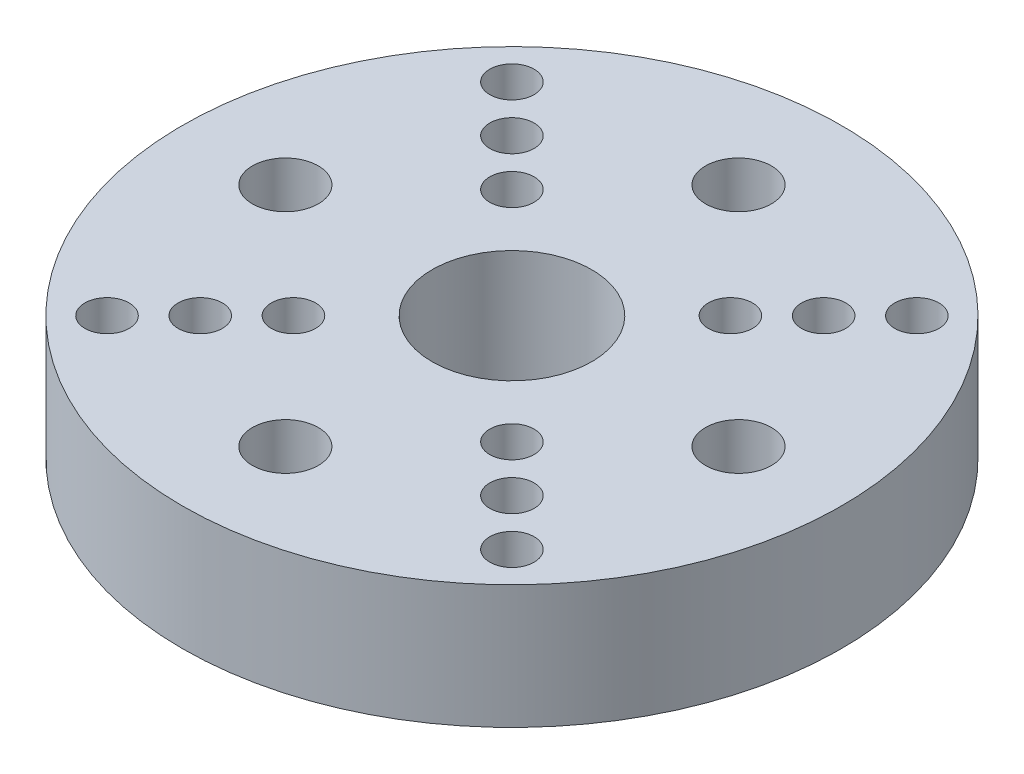
ISO-10303-21;
HEADER;
FILE_DESCRIPTION(('STEP AP214'),'2;1');
FILE_NAME('part.step','',(''),(''),'','','');
FILE_SCHEMA(('AUTOMOTIVE_DESIGN { 1 0 10303 214 1 1 1 1 }'));
ENDSEC;
DATA;
#1=APPLICATION_CONTEXT('core data for automotive mechanical design processes');
#2=APPLICATION_PROTOCOL_DEFINITION('international standard','automotive_design',2000,#1);
#3=PRODUCT_CONTEXT('',#1,'mechanical');
#4=PRODUCT('Part','Part','',(#3));
#5=PRODUCT_RELATED_PRODUCT_CATEGORY('part','',(#4));
#6=PRODUCT_DEFINITION_FORMATION('','',#4);
#7=PRODUCT_DEFINITION_CONTEXT('part definition',#1,'design');
#8=PRODUCT_DEFINITION('design','',#6,#7);
#9=PRODUCT_DEFINITION_SHAPE('','',#8);
#10=(LENGTH_UNIT() NAMED_UNIT(*) SI_UNIT(.MILLI.,.METRE.));
#11=(NAMED_UNIT(*) PLANE_ANGLE_UNIT() SI_UNIT($,.RADIAN.));
#12=(NAMED_UNIT(*) SI_UNIT($,.STERADIAN.) SOLID_ANGLE_UNIT());
#13=UNCERTAINTY_MEASURE_WITH_UNIT(LENGTH_MEASURE(1.E-05),#10,'distance_accuracy_value','');
#14=(GEOMETRIC_REPRESENTATION_CONTEXT(3) GLOBAL_UNCERTAINTY_ASSIGNED_CONTEXT((#13)) GLOBAL_UNIT_ASSIGNED_CONTEXT((#10,
#11,#12)) REPRESENTATION_CONTEXT('',''));
#15=CARTESIAN_POINT('',(0.,0.,0.));
#16=DIRECTION('',(0.,0.,1.));
#17=DIRECTION('',(1.,0.,0.));
#18=AXIS2_PLACEMENT_3D('',#15,#16,#17);
#19=CARTESIAN_POINT('',(0.,6.,0.));
#20=DIRECTION('',(0.,-1.,0.));
#21=DIRECTION('',(0.,0.,-1.));
#22=AXIS2_PLACEMENT_3D('',#19,#20,#21);
#23=CYLINDRICAL_SURFACE('',#22,16.);
#24=CARTESIAN_POINT('',(0.,6.,0.));
#25=DIRECTION('',(0.,1.,0.));
#26=DIRECTION('',(0.,0.,1.));
#27=AXIS2_PLACEMENT_3D('',#24,#25,#26);
#28=CIRCLE('',#27,16.);
#29=CARTESIAN_POINT('',(0.,6.,16.));
#30=VERTEX_POINT('',#29);
#31=EDGE_CURVE('E10',#30,#30,#28,.T.);
#32=ORIENTED_EDGE('',*,*,#31,.F.);
#33=EDGE_LOOP('',(#32));
#34=FACE_BOUND('',#33,.T.);
#35=CARTESIAN_POINT('',(0.,0.,0.));
#36=DIRECTION('',(0.,1.,0.));
#37=DIRECTION('',(0.,0.,1.));
#38=AXIS2_PLACEMENT_3D('',#35,#36,#37);
#39=CIRCLE('',#38,16.);
#40=CARTESIAN_POINT('',(0.,0.,16.));
#41=VERTEX_POINT('',#40);
#42=EDGE_CURVE('E35',#41,#41,#39,.T.);
#43=ORIENTED_EDGE('',*,*,#42,.T.);
#44=EDGE_LOOP('',(#43));
#45=FACE_BOUND('',#44,.T.);
#46=ADVANCED_FACE('F32',(#34,#45),#23,.T.);
#47=CARTESIAN_POINT('',(0.,6.,0.));
#48=DIRECTION('',(0.,1.,0.));
#49=DIRECTION('',(0.,0.,1.));
#50=AXIS2_PLACEMENT_3D('',#47,#48,#49);
#51=PLANE('',#50);
#52=CARTESIAN_POINT('',(0.,6.,11.));
#53=DIRECTION('',(0.,1.,0.));
#54=DIRECTION('',(0.,0.,1.));
#55=AXIS2_PLACEMENT_3D('',#52,#53,#54);
#56=CIRCLE('',#55,1.6);
#57=CARTESIAN_POINT('',(0.,6.,12.6));
#58=VERTEX_POINT('',#57);
#59=EDGE_CURVE('E102',#58,#58,#56,.F.);
#60=ORIENTED_EDGE('',*,*,#59,.T.);
#61=EDGE_LOOP('',(#60));
#62=FACE_BOUND('',#61,.T.);
#63=CARTESIAN_POINT('',(-11.,6.,0.));
#64=DIRECTION('',(0.,1.,0.));
#65=DIRECTION('',(0.,0.,1.));
#66=AXIS2_PLACEMENT_3D('',#63,#64,#65);
#67=CIRCLE('',#66,1.6);
#68=CARTESIAN_POINT('',(-11.,6.,1.6));
#69=VERTEX_POINT('',#68);
#70=EDGE_CURVE('E124',#69,#69,#67,.F.);
#71=ORIENTED_EDGE('',*,*,#70,.T.);
#72=EDGE_LOOP('',(#71));
#73=FACE_BOUND('',#72,.T.);
#74=CARTESIAN_POINT('',(0.,6.,-11.));
#75=DIRECTION('',(0.,1.,0.));
#76=DIRECTION('',(0.,0.,1.));
#77=AXIS2_PLACEMENT_3D('',#74,#75,#76);
#78=CIRCLE('',#77,1.6);
#79=CARTESIAN_POINT('',(0.,6.,-9.4));
#80=VERTEX_POINT('',#79);
#81=EDGE_CURVE('E127',#80,#80,#78,.F.);
#82=ORIENTED_EDGE('',*,*,#81,.T.);
#83=EDGE_LOOP('',(#82));
#84=FACE_BOUND('',#83,.T.);
#85=CARTESIAN_POINT('',(11.,6.,0.));
#86=DIRECTION('',(0.,1.,0.));
#87=DIRECTION('',(0.,0.,1.));
#88=AXIS2_PLACEMENT_3D('',#85,#86,#87);
#89=CIRCLE('',#88,1.6);
#90=CARTESIAN_POINT('',(11.,6.,1.6));
#91=VERTEX_POINT('',#90);
#92=EDGE_CURVE('E130',#91,#91,#89,.F.);
#93=ORIENTED_EDGE('',*,*,#92,.T.);
#94=EDGE_LOOP('',(#93));
#95=FACE_BOUND('',#94,.T.);
#96=CARTESIAN_POINT('',(7.56604255869606,6.,7.56604255869606));
#97=DIRECTION('',(0.,1.,0.));
#98=DIRECTION('',(0.,0.,1.));
#99=AXIS2_PLACEMENT_3D('',#96,#97,#98);
#100=CIRCLE('',#99,1.075);
#101=CARTESIAN_POINT('',(7.56604255869606,6.,8.64104255869606));
#102=VERTEX_POINT('',#101);
#103=EDGE_CURVE('E77',#102,#102,#100,.T.);
#104=ORIENTED_EDGE('',*,*,#103,.F.);
#105=EDGE_LOOP('',(#104));
#106=FACE_BOUND('',#105,.T.);
#107=CARTESIAN_POINT('',(5.30330085889911,6.,5.3033008588991));
#108=DIRECTION('',(0.,1.,0.));
#109=DIRECTION('',(0.,0.,1.));
#110=AXIS2_PLACEMENT_3D('',#107,#108,#109);
#111=CIRCLE('',#110,1.075);
#112=CARTESIAN_POINT('',(5.30330085889911,6.,6.3783008588991));
#113=VERTEX_POINT('',#112);
#114=EDGE_CURVE('E84',#113,#113,#111,.T.);
#115=ORIENTED_EDGE('',*,*,#114,.F.);
#116=EDGE_LOOP('',(#115));
#117=FACE_BOUND('',#116,.T.);
#118=CARTESIAN_POINT('',(9.82878425849301,6.,-9.82878425849301));
#119=DIRECTION('',(0.,1.,0.));
#120=DIRECTION('',(0.,0.,1.));
#121=AXIS2_PLACEMENT_3D('',#118,#119,#120);
#122=CIRCLE('',#121,1.075);
#123=CARTESIAN_POINT('',(9.82878425849301,6.,-8.75378425849301));
#124=VERTEX_POINT('',#123);
#125=EDGE_CURVE('E90',#124,#124,#122,.T.);
#126=ORIENTED_EDGE('',*,*,#125,.F.);
#127=EDGE_LOOP('',(#126));
#128=FACE_BOUND('',#127,.T.);
#129=CARTESIAN_POINT('',(7.56604255869606,6.,-7.56604255869606));
#130=DIRECTION('',(0.,1.,0.));
#131=DIRECTION('',(0.,0.,1.));
#132=AXIS2_PLACEMENT_3D('',#129,#130,#131);
#133=CIRCLE('',#132,1.075);
#134=CARTESIAN_POINT('',(7.56604255869606,6.,-6.49104255869606));
#135=VERTEX_POINT('',#134);
#136=EDGE_CURVE('E66',#135,#135,#133,.T.);
#137=ORIENTED_EDGE('',*,*,#136,.F.);
#138=EDGE_LOOP('',(#137));
#139=FACE_BOUND('',#138,.T.);
#140=CARTESIAN_POINT('',(-5.30330085889911,6.,-5.30330085889911));
#141=DIRECTION('',(0.,1.,0.));
#142=DIRECTION('',(0.,0.,1.));
#143=AXIS2_PLACEMENT_3D('',#140,#141,#142);
#144=CIRCLE('',#143,1.075);
#145=CARTESIAN_POINT('',(-5.30330085889911,6.,-4.22830085889911));
#146=VERTEX_POINT('',#145);
#147=EDGE_CURVE('E47',#146,#146,#144,.T.);
#148=ORIENTED_EDGE('',*,*,#147,.F.);
#149=EDGE_LOOP('',(#148));
#150=FACE_BOUND('',#149,.T.);
#151=CARTESIAN_POINT('',(-7.56604255869606,6.,-7.56604255869606));
#152=DIRECTION('',(0.,1.,0.));
#153=DIRECTION('',(0.,0.,1.));
#154=AXIS2_PLACEMENT_3D('',#151,#152,#153);
#155=CIRCLE('',#154,1.075);
#156=CARTESIAN_POINT('',(-7.56604255869606,6.,-6.49104255869606));
#157=VERTEX_POINT('',#156);
#158=EDGE_CURVE('E53',#157,#157,#155,.T.);
#159=ORIENTED_EDGE('',*,*,#158,.F.);
#160=EDGE_LOOP('',(#159));
#161=FACE_BOUND('',#160,.T.);
#162=CARTESIAN_POINT('',(-9.82878425849301,6.,-9.82878425849301));
#163=DIRECTION('',(0.,1.,0.));
#164=DIRECTION('',(0.,0.,1.));
#165=AXIS2_PLACEMENT_3D('',#162,#163,#164);
#166=CIRCLE('',#165,1.075);
#167=CARTESIAN_POINT('',(-9.82878425849301,6.,-8.75378425849301));
#168=VERTEX_POINT('',#167);
#169=EDGE_CURVE('E54',#168,#168,#166,.T.);
#170=ORIENTED_EDGE('',*,*,#169,.F.);
#171=EDGE_LOOP('',(#170));
#172=FACE_BOUND('',#171,.T.);
#173=CARTESIAN_POINT('',(5.30330085889911,6.,-5.30330085889911));
#174=DIRECTION('',(0.,1.,0.));
#175=DIRECTION('',(0.,0.,1.));
#176=AXIS2_PLACEMENT_3D('',#173,#174,#175);
#177=CIRCLE('',#176,1.075);
#178=CARTESIAN_POINT('',(5.30330085889911,6.,-4.22830085889911));
#179=VERTEX_POINT('',#178);
#180=EDGE_CURVE('E65',#179,#179,#177,.T.);
#181=ORIENTED_EDGE('',*,*,#180,.F.);
#182=EDGE_LOOP('',(#181));
#183=FACE_BOUND('',#182,.T.);
#184=CARTESIAN_POINT('',(9.82878425849301,6.,9.82878425849301));
#185=DIRECTION('',(0.,1.,0.));
#186=DIRECTION('',(0.,0.,1.));
#187=AXIS2_PLACEMENT_3D('',#184,#185,#186);
#188=CIRCLE('',#187,1.075);
#189=CARTESIAN_POINT('',(9.82878425849301,6.,10.903784258493));
#190=VERTEX_POINT('',#189);
#191=EDGE_CURVE('E78',#190,#190,#188,.T.);
#192=ORIENTED_EDGE('',*,*,#191,.F.);
#193=EDGE_LOOP('',(#192));
#194=FACE_BOUND('',#193,.T.);
#195=CARTESIAN_POINT('',(-5.3033008588991,6.,5.30330085889911));
#196=DIRECTION('',(0.,1.,0.));
#197=DIRECTION('',(0.,0.,1.));
#198=AXIS2_PLACEMENT_3D('',#195,#196,#197);
#199=CIRCLE('',#198,1.075);
#200=CARTESIAN_POINT('',(-5.3033008588991,6.,6.37830085889911));
#201=VERTEX_POINT('',#200);
#202=EDGE_CURVE('E114',#201,#201,#199,.T.);
#203=ORIENTED_EDGE('',*,*,#202,.F.);
#204=EDGE_LOOP('',(#203));
#205=FACE_BOUND('',#204,.T.);
#206=CARTESIAN_POINT('',(-7.56604255869606,6.,7.56604255869606));
#207=DIRECTION('',(0.,1.,0.));
#208=DIRECTION('',(0.,0.,1.));
#209=AXIS2_PLACEMENT_3D('',#206,#207,#208);
#210=CIRCLE('',#209,1.075);
#211=CARTESIAN_POINT('',(-7.56604255869606,6.,8.64104255869606));
#212=VERTEX_POINT('',#211);
#213=EDGE_CURVE('E108',#212,#212,#210,.T.);
#214=ORIENTED_EDGE('',*,*,#213,.F.);
#215=EDGE_LOOP('',(#214));
#216=FACE_BOUND('',#215,.T.);
#217=CARTESIAN_POINT('',(-9.82878425849301,6.,9.82878425849301));
#218=DIRECTION('',(0.,1.,0.));
#219=DIRECTION('',(0.,0.,1.));
#220=AXIS2_PLACEMENT_3D('',#217,#218,#219);
#221=CIRCLE('',#220,1.075);
#222=CARTESIAN_POINT('',(-9.82878425849301,6.,10.903784258493));
#223=VERTEX_POINT('',#222);
#224=EDGE_CURVE('E101',#223,#223,#221,.T.);
#225=ORIENTED_EDGE('',*,*,#224,.F.);
#226=EDGE_LOOP('',(#225));
#227=FACE_BOUND('',#226,.T.);
#228=CARTESIAN_POINT('',(0.,6.,0.));
#229=DIRECTION('',(0.,1.,0.));
#230=DIRECTION('',(0.,0.,1.));
#231=AXIS2_PLACEMENT_3D('',#228,#229,#230);
#232=CIRCLE('',#231,3.875);
#233=CARTESIAN_POINT('',(0.,6.,3.875));
#234=VERTEX_POINT('',#233);
#235=EDGE_CURVE('E42',#234,#234,#232,.T.);
#236=ORIENTED_EDGE('',*,*,#235,.F.);
#237=EDGE_LOOP('',(#236));
#238=FACE_BOUND('',#237,.T.);
#239=ORIENTED_EDGE('',*,*,#31,.T.);
#240=EDGE_LOOP('',(#239));
#241=FACE_BOUND('',#240,.T.);
#242=ADVANCED_FACE('F162',(#62,#73,#84,#95,#106,#117,#128,#139,#150,#161,#172,#183,#194,#205,
#216,#227,#238,#241),#51,.T.);
#243=CARTESIAN_POINT('',(0.,0.,0.));
#244=DIRECTION('',(0.,1.,0.));
#245=DIRECTION('',(0.,0.,1.));
#246=AXIS2_PLACEMENT_3D('',#243,#244,#245);
#247=PLANE('',#246);
#248=CARTESIAN_POINT('',(0.,0.,11.));
#249=DIRECTION('',(0.,1.,0.));
#250=DIRECTION('',(0.,0.,1.));
#251=AXIS2_PLACEMENT_3D('',#248,#249,#250);
#252=CIRCLE('',#251,1.6);
#253=CARTESIAN_POINT('',(0.,0.,12.6));
#254=VERTEX_POINT('',#253);
#255=EDGE_CURVE('E133',#254,#254,#252,.T.);
#256=ORIENTED_EDGE('',*,*,#255,.T.);
#257=EDGE_LOOP('',(#256));
#258=FACE_BOUND('',#257,.T.);
#259=CARTESIAN_POINT('',(-11.,0.,0.));
#260=DIRECTION('',(0.,1.,0.));
#261=DIRECTION('',(0.,0.,1.));
#262=AXIS2_PLACEMENT_3D('',#259,#260,#261);
#263=CIRCLE('',#262,1.6);
#264=CARTESIAN_POINT('',(-11.,0.,1.6));
#265=VERTEX_POINT('',#264);
#266=EDGE_CURVE('E140',#265,#265,#263,.T.);
#267=ORIENTED_EDGE('',*,*,#266,.T.);
#268=EDGE_LOOP('',(#267));
#269=FACE_BOUND('',#268,.T.);
#270=CARTESIAN_POINT('',(0.,0.,-11.));
#271=DIRECTION('',(0.,1.,0.));
#272=DIRECTION('',(0.,0.,1.));
#273=AXIS2_PLACEMENT_3D('',#270,#271,#272);
#274=CIRCLE('',#273,1.6);
#275=CARTESIAN_POINT('',(0.,0.,-9.4));
#276=VERTEX_POINT('',#275);
#277=EDGE_CURVE('E137',#276,#276,#274,.T.);
#278=ORIENTED_EDGE('',*,*,#277,.T.);
#279=EDGE_LOOP('',(#278));
#280=FACE_BOUND('',#279,.T.);
#281=CARTESIAN_POINT('',(11.,0.,0.));
#282=DIRECTION('',(0.,1.,0.));
#283=DIRECTION('',(0.,0.,1.));
#284=AXIS2_PLACEMENT_3D('',#281,#282,#283);
#285=CIRCLE('',#284,1.6);
#286=CARTESIAN_POINT('',(11.,0.,1.6));
#287=VERTEX_POINT('',#286);
#288=EDGE_CURVE('E134',#287,#287,#285,.T.);
#289=ORIENTED_EDGE('',*,*,#288,.T.);
#290=EDGE_LOOP('',(#289));
#291=FACE_BOUND('',#290,.T.);
#292=CARTESIAN_POINT('',(7.56604255869606,0.,7.56604255869606));
#293=DIRECTION('',(0.,1.,0.));
#294=DIRECTION('',(0.,0.,1.));
#295=AXIS2_PLACEMENT_3D('',#292,#293,#294);
#296=CIRCLE('',#295,1.075);
#297=CARTESIAN_POINT('',(7.56604255869606,0.,8.64104255869606));
#298=VERTEX_POINT('',#297);
#299=EDGE_CURVE('E74',#298,#298,#296,.T.);
#300=ORIENTED_EDGE('',*,*,#299,.T.);
#301=EDGE_LOOP('',(#300));
#302=FACE_BOUND('',#301,.T.);
#303=CARTESIAN_POINT('',(5.30330085889911,0.,5.3033008588991));
#304=DIRECTION('',(0.,1.,0.));
#305=DIRECTION('',(0.,0.,1.));
#306=AXIS2_PLACEMENT_3D('',#303,#304,#305);
#307=CIRCLE('',#306,1.075);
#308=CARTESIAN_POINT('',(5.30330085889911,0.,6.3783008588991));
#309=VERTEX_POINT('',#308);
#310=EDGE_CURVE('E81',#309,#309,#307,.T.);
#311=ORIENTED_EDGE('',*,*,#310,.T.);
#312=EDGE_LOOP('',(#311));
#313=FACE_BOUND('',#312,.T.);
#314=CARTESIAN_POINT('',(9.82878425849301,0.,-9.82878425849301));
#315=DIRECTION('',(0.,1.,0.));
#316=DIRECTION('',(0.,0.,1.));
#317=AXIS2_PLACEMENT_3D('',#314,#315,#316);
#318=CIRCLE('',#317,1.075);
#319=CARTESIAN_POINT('',(9.82878425849301,0.,-8.75378425849301));
#320=VERTEX_POINT('',#319);
#321=EDGE_CURVE('E87',#320,#320,#318,.T.);
#322=ORIENTED_EDGE('',*,*,#321,.T.);
#323=EDGE_LOOP('',(#322));
#324=FACE_BOUND('',#323,.T.);
#325=CARTESIAN_POINT('',(7.56604255869606,0.,-7.56604255869606));
#326=DIRECTION('',(0.,1.,0.));
#327=DIRECTION('',(0.,0.,1.));
#328=AXIS2_PLACEMENT_3D('',#325,#326,#327);
#329=CIRCLE('',#328,1.075);
#330=CARTESIAN_POINT('',(7.56604255869606,0.,-6.49104255869606));
#331=VERTEX_POINT('',#330);
#332=EDGE_CURVE('E93',#331,#331,#329,.T.);
#333=ORIENTED_EDGE('',*,*,#332,.T.);
#334=EDGE_LOOP('',(#333));
#335=FACE_BOUND('',#334,.T.);
#336=CARTESIAN_POINT('',(-5.30330085889911,0.,-5.30330085889911));
#337=DIRECTION('',(0.,1.,0.));
#338=DIRECTION('',(0.,0.,1.));
#339=AXIS2_PLACEMENT_3D('',#336,#337,#338);
#340=CIRCLE('',#339,1.075);
#341=CARTESIAN_POINT('',(-5.30330085889911,0.,-4.22830085889911));
#342=VERTEX_POINT('',#341);
#343=EDGE_CURVE('E57',#342,#342,#340,.T.);
#344=ORIENTED_EDGE('',*,*,#343,.T.);
#345=EDGE_LOOP('',(#344));
#346=FACE_BOUND('',#345,.T.);
#347=CARTESIAN_POINT('',(-7.56604255869606,0.,-7.56604255869606));
#348=DIRECTION('',(0.,1.,0.));
#349=DIRECTION('',(0.,0.,1.));
#350=AXIS2_PLACEMENT_3D('',#347,#348,#349);
#351=CIRCLE('',#350,1.075);
#352=CARTESIAN_POINT('',(-7.56604255869606,0.,-6.49104255869606));
#353=VERTEX_POINT('',#352);
#354=EDGE_CURVE('E50',#353,#353,#351,.T.);
#355=ORIENTED_EDGE('',*,*,#354,.T.);
#356=EDGE_LOOP('',(#355));
#357=FACE_BOUND('',#356,.T.);
#358=CARTESIAN_POINT('',(-9.82878425849301,0.,-9.82878425849301));
#359=DIRECTION('',(0.,1.,0.));
#360=DIRECTION('',(0.,0.,1.));
#361=AXIS2_PLACEMENT_3D('',#358,#359,#360);
#362=CIRCLE('',#361,1.075);
#363=CARTESIAN_POINT('',(-9.82878425849301,0.,-8.75378425849301));
#364=VERTEX_POINT('',#363);
#365=EDGE_CURVE('E69',#364,#364,#362,.T.);
#366=ORIENTED_EDGE('',*,*,#365,.T.);
#367=EDGE_LOOP('',(#366));
#368=FACE_BOUND('',#367,.T.);
#369=CARTESIAN_POINT('',(5.30330085889911,0.,-5.30330085889911));
#370=DIRECTION('',(0.,1.,0.));
#371=DIRECTION('',(0.,0.,1.));
#372=AXIS2_PLACEMENT_3D('',#369,#370,#371);
#373=CIRCLE('',#372,1.075);
#374=CARTESIAN_POINT('',(5.30330085889911,0.,-4.22830085889911));
#375=VERTEX_POINT('',#374);
#376=EDGE_CURVE('E62',#375,#375,#373,.T.);
#377=ORIENTED_EDGE('',*,*,#376,.T.);
#378=EDGE_LOOP('',(#377));
#379=FACE_BOUND('',#378,.T.);
#380=CARTESIAN_POINT('',(9.82878425849301,0.,9.82878425849301));
#381=DIRECTION('',(0.,1.,0.));
#382=DIRECTION('',(0.,0.,1.));
#383=AXIS2_PLACEMENT_3D('',#380,#381,#382);
#384=CIRCLE('',#383,1.075);
#385=CARTESIAN_POINT('',(9.82878425849301,0.,10.903784258493));
#386=VERTEX_POINT('',#385);
#387=EDGE_CURVE('E117',#386,#386,#384,.T.);
#388=ORIENTED_EDGE('',*,*,#387,.T.);
#389=EDGE_LOOP('',(#388));
#390=FACE_BOUND('',#389,.T.);
#391=CARTESIAN_POINT('',(-5.3033008588991,0.,5.30330085889911));
#392=DIRECTION('',(0.,1.,0.));
#393=DIRECTION('',(0.,0.,1.));
#394=AXIS2_PLACEMENT_3D('',#391,#392,#393);
#395=CIRCLE('',#394,1.075);
#396=CARTESIAN_POINT('',(-5.3033008588991,0.,6.37830085889911));
#397=VERTEX_POINT('',#396);
#398=EDGE_CURVE('E111',#397,#397,#395,.T.);
#399=ORIENTED_EDGE('',*,*,#398,.T.);
#400=EDGE_LOOP('',(#399));
#401=FACE_BOUND('',#400,.T.);
#402=CARTESIAN_POINT('',(-7.56604255869606,0.,7.56604255869606));
#403=DIRECTION('',(0.,1.,0.));
#404=DIRECTION('',(0.,0.,1.));
#405=AXIS2_PLACEMENT_3D('',#402,#403,#404);
#406=CIRCLE('',#405,1.075);
#407=CARTESIAN_POINT('',(-7.56604255869606,0.,8.64104255869606));
#408=VERTEX_POINT('',#407);
#409=EDGE_CURVE('E105',#408,#408,#406,.T.);
#410=ORIENTED_EDGE('',*,*,#409,.T.);
#411=EDGE_LOOP('',(#410));
#412=FACE_BOUND('',#411,.T.);
#413=CARTESIAN_POINT('',(-9.82878425849301,0.,9.82878425849301));
#414=DIRECTION('',(0.,1.,0.));
#415=DIRECTION('',(0.,0.,1.));
#416=AXIS2_PLACEMENT_3D('',#413,#414,#415);
#417=CIRCLE('',#416,1.075);
#418=CARTESIAN_POINT('',(-9.82878425849301,0.,10.903784258493));
#419=VERTEX_POINT('',#418);
#420=EDGE_CURVE('E98',#419,#419,#417,.T.);
#421=ORIENTED_EDGE('',*,*,#420,.T.);
#422=EDGE_LOOP('',(#421));
#423=FACE_BOUND('',#422,.T.);
#424=CARTESIAN_POINT('',(0.,0.,0.));
#425=DIRECTION('',(0.,1.,0.));
#426=DIRECTION('',(0.,0.,1.));
#427=AXIS2_PLACEMENT_3D('',#424,#425,#426);
#428=CIRCLE('',#427,3.875);
#429=CARTESIAN_POINT('',(0.,0.,3.875));
#430=VERTEX_POINT('',#429);
#431=EDGE_CURVE('E44',#430,#430,#428,.T.);
#432=ORIENTED_EDGE('',*,*,#431,.T.);
#433=EDGE_LOOP('',(#432));
#434=FACE_BOUND('',#433,.T.);
#435=ORIENTED_EDGE('',*,*,#42,.F.);
#436=EDGE_LOOP('',(#435));
#437=FACE_BOUND('',#436,.T.);
#438=ADVANCED_FACE('F146',(#258,#269,#280,#291,#302,#313,#324,#335,#346,#357,#368,#379,#390,
#401,#412,#423,#434,#437),#247,.F.);
#439=CARTESIAN_POINT('',(0.,6.,0.));
#440=DIRECTION('',(0.,-1.,0.));
#441=DIRECTION('',(0.,0.,-1.));
#442=AXIS2_PLACEMENT_3D('',#439,#440,#441);
#443=CYLINDRICAL_SURFACE('',#442,3.875);
#444=ORIENTED_EDGE('',*,*,#235,.T.);
#445=EDGE_LOOP('',(#444));
#446=FACE_BOUND('',#445,.T.);
#447=ORIENTED_EDGE('',*,*,#431,.F.);
#448=EDGE_LOOP('',(#447));
#449=FACE_BOUND('',#448,.T.);
#450=ADVANCED_FACE('F173',(#446,#449),#443,.F.);
#451=CARTESIAN_POINT('',(-9.82878425849301,6.,9.82878425849301));
#452=DIRECTION('',(0.,-1.,0.));
#453=DIRECTION('',(0.,0.,-1.));
#454=AXIS2_PLACEMENT_3D('',#451,#452,#453);
#455=CYLINDRICAL_SURFACE('',#454,1.075);
#456=ORIENTED_EDGE('',*,*,#224,.T.);
#457=EDGE_LOOP('',(#456));
#458=FACE_BOUND('',#457,.T.);
#459=ORIENTED_EDGE('',*,*,#420,.F.);
#460=EDGE_LOOP('',(#459));
#461=FACE_BOUND('',#460,.T.);
#462=ADVANCED_FACE('F177',(#458,#461),#455,.F.);
#463=CARTESIAN_POINT('',(-7.56604255869606,6.,7.56604255869606));
#464=DIRECTION('',(0.,-1.,0.));
#465=DIRECTION('',(0.,0.,-1.));
#466=AXIS2_PLACEMENT_3D('',#463,#464,#465);
#467=CYLINDRICAL_SURFACE('',#466,1.075);
#468=ORIENTED_EDGE('',*,*,#213,.T.);
#469=EDGE_LOOP('',(#468));
#470=FACE_BOUND('',#469,.T.);
#471=ORIENTED_EDGE('',*,*,#409,.F.);
#472=EDGE_LOOP('',(#471));
#473=FACE_BOUND('',#472,.T.);
#474=ADVANCED_FACE('F217',(#470,#473),#467,.F.);
#475=CARTESIAN_POINT('',(-5.3033008588991,6.,5.30330085889911));
#476=DIRECTION('',(0.,-1.,0.));
#477=DIRECTION('',(0.,0.,-1.));
#478=AXIS2_PLACEMENT_3D('',#475,#476,#477);
#479=CYLINDRICAL_SURFACE('',#478,1.075);
#480=ORIENTED_EDGE('',*,*,#202,.T.);
#481=EDGE_LOOP('',(#480));
#482=FACE_BOUND('',#481,.T.);
#483=ORIENTED_EDGE('',*,*,#398,.F.);
#484=EDGE_LOOP('',(#483));
#485=FACE_BOUND('',#484,.T.);
#486=ADVANCED_FACE('F221',(#482,#485),#479,.F.);
#487=CARTESIAN_POINT('',(9.82878425849301,6.,9.82878425849301));
#488=DIRECTION('',(0.,-1.,0.));
#489=DIRECTION('',(0.,0.,-1.));
#490=AXIS2_PLACEMENT_3D('',#487,#488,#489);
#491=CYLINDRICAL_SURFACE('',#490,1.075);
#492=ORIENTED_EDGE('',*,*,#191,.T.);
#493=EDGE_LOOP('',(#492));
#494=FACE_BOUND('',#493,.T.);
#495=ORIENTED_EDGE('',*,*,#387,.F.);
#496=EDGE_LOOP('',(#495));
#497=FACE_BOUND('',#496,.T.);
#498=ADVANCED_FACE('F194',(#494,#497),#491,.F.);
#499=CARTESIAN_POINT('',(5.30330085889911,6.,-5.30330085889911));
#500=DIRECTION('',(0.,-1.,0.));
#501=DIRECTION('',(0.,0.,-1.));
#502=AXIS2_PLACEMENT_3D('',#499,#500,#501);
#503=CYLINDRICAL_SURFACE('',#502,1.075);
#504=ORIENTED_EDGE('',*,*,#180,.T.);
#505=EDGE_LOOP('',(#504));
#506=FACE_BOUND('',#505,.T.);
#507=ORIENTED_EDGE('',*,*,#376,.F.);
#508=EDGE_LOOP('',(#507));
#509=FACE_BOUND('',#508,.T.);
#510=ADVANCED_FACE('F191',(#506,#509),#503,.F.);
#511=CARTESIAN_POINT('',(-9.82878425849301,6.,-9.82878425849301));
#512=DIRECTION('',(0.,-1.,0.));
#513=DIRECTION('',(0.,0.,-1.));
#514=AXIS2_PLACEMENT_3D('',#511,#512,#513);
#515=CYLINDRICAL_SURFACE('',#514,1.075);
#516=ORIENTED_EDGE('',*,*,#169,.T.);
#517=EDGE_LOOP('',(#516));
#518=FACE_BOUND('',#517,.T.);
#519=ORIENTED_EDGE('',*,*,#365,.F.);
#520=EDGE_LOOP('',(#519));
#521=FACE_BOUND('',#520,.T.);
#522=ADVANCED_FACE('F185',(#518,#521),#515,.F.);
#523=CARTESIAN_POINT('',(-7.56604255869606,6.,-7.56604255869606));
#524=DIRECTION('',(0.,-1.,0.));
#525=DIRECTION('',(0.,0.,-1.));
#526=AXIS2_PLACEMENT_3D('',#523,#524,#525);
#527=CYLINDRICAL_SURFACE('',#526,1.075);
#528=ORIENTED_EDGE('',*,*,#158,.T.);
#529=EDGE_LOOP('',(#528));
#530=FACE_BOUND('',#529,.T.);
#531=ORIENTED_EDGE('',*,*,#354,.F.);
#532=EDGE_LOOP('',(#531));
#533=FACE_BOUND('',#532,.T.);
#534=ADVANCED_FACE('F181',(#530,#533),#527,.F.);
#535=CARTESIAN_POINT('',(-5.30330085889911,6.,-5.30330085889911));
#536=DIRECTION('',(0.,-1.,0.));
#537=DIRECTION('',(0.,0.,-1.));
#538=AXIS2_PLACEMENT_3D('',#535,#536,#537);
#539=CYLINDRICAL_SURFACE('',#538,1.075);
#540=ORIENTED_EDGE('',*,*,#147,.T.);
#541=EDGE_LOOP('',(#540));
#542=FACE_BOUND('',#541,.T.);
#543=ORIENTED_EDGE('',*,*,#343,.F.);
#544=EDGE_LOOP('',(#543));
#545=FACE_BOUND('',#544,.T.);
#546=ADVANCED_FACE('F184',(#542,#545),#539,.F.);
#547=CARTESIAN_POINT('',(7.56604255869606,6.,-7.56604255869606));
#548=DIRECTION('',(0.,-1.,0.));
#549=DIRECTION('',(0.,0.,-1.));
#550=AXIS2_PLACEMENT_3D('',#547,#548,#549);
#551=CYLINDRICAL_SURFACE('',#550,1.075);
#552=ORIENTED_EDGE('',*,*,#136,.T.);
#553=EDGE_LOOP('',(#552));
#554=FACE_BOUND('',#553,.T.);
#555=ORIENTED_EDGE('',*,*,#332,.F.);
#556=EDGE_LOOP('',(#555));
#557=FACE_BOUND('',#556,.T.);
#558=ADVANCED_FACE('F189',(#554,#557),#551,.F.);
#559=CARTESIAN_POINT('',(9.82878425849301,6.,-9.82878425849301));
#560=DIRECTION('',(0.,-1.,0.));
#561=DIRECTION('',(0.,0.,-1.));
#562=AXIS2_PLACEMENT_3D('',#559,#560,#561);
#563=CYLINDRICAL_SURFACE('',#562,1.075);
#564=ORIENTED_EDGE('',*,*,#125,.T.);
#565=EDGE_LOOP('',(#564));
#566=FACE_BOUND('',#565,.T.);
#567=ORIENTED_EDGE('',*,*,#321,.F.);
#568=EDGE_LOOP('',(#567));
#569=FACE_BOUND('',#568,.T.);
#570=ADVANCED_FACE('F207',(#566,#569),#563,.F.);
#571=CARTESIAN_POINT('',(5.30330085889911,6.,5.3033008588991));
#572=DIRECTION('',(0.,-1.,0.));
#573=DIRECTION('',(0.,0.,-1.));
#574=AXIS2_PLACEMENT_3D('',#571,#572,#573);
#575=CYLINDRICAL_SURFACE('',#574,1.075);
#576=ORIENTED_EDGE('',*,*,#114,.T.);
#577=EDGE_LOOP('',(#576));
#578=FACE_BOUND('',#577,.T.);
#579=ORIENTED_EDGE('',*,*,#310,.F.);
#580=EDGE_LOOP('',(#579));
#581=FACE_BOUND('',#580,.T.);
#582=ADVANCED_FACE('F203',(#578,#581),#575,.F.);
#583=CARTESIAN_POINT('',(7.56604255869606,6.,7.56604255869606));
#584=DIRECTION('',(0.,-1.,0.));
#585=DIRECTION('',(0.,0.,-1.));
#586=AXIS2_PLACEMENT_3D('',#583,#584,#585);
#587=CYLINDRICAL_SURFACE('',#586,1.075);
#588=ORIENTED_EDGE('',*,*,#103,.T.);
#589=EDGE_LOOP('',(#588));
#590=FACE_BOUND('',#589,.T.);
#591=ORIENTED_EDGE('',*,*,#299,.F.);
#592=EDGE_LOOP('',(#591));
#593=FACE_BOUND('',#592,.T.);
#594=ADVANCED_FACE('F199',(#590,#593),#587,.F.);
#595=CARTESIAN_POINT('',(11.,40.,0.));
#596=DIRECTION('',(0.,-1.,0.));
#597=DIRECTION('',(0.,0.,-1.));
#598=AXIS2_PLACEMENT_3D('',#595,#596,#597);
#599=CYLINDRICAL_SURFACE('',#598,1.6);
#600=ORIENTED_EDGE('',*,*,#92,.F.);
#601=EDGE_LOOP('',(#600));
#602=FACE_BOUND('',#601,.T.);
#603=ORIENTED_EDGE('',*,*,#288,.F.);
#604=EDGE_LOOP('',(#603));
#605=FACE_BOUND('',#604,.T.);
#606=ADVANCED_FACE('F202',(#602,#605),#599,.F.);
#607=CARTESIAN_POINT('',(0.,40.,-11.));
#608=DIRECTION('',(0.,-1.,0.));
#609=DIRECTION('',(0.,0.,-1.));
#610=AXIS2_PLACEMENT_3D('',#607,#608,#609);
#611=CYLINDRICAL_SURFACE('',#610,1.6);
#612=ORIENTED_EDGE('',*,*,#81,.F.);
#613=EDGE_LOOP('',(#612));
#614=FACE_BOUND('',#613,.T.);
#615=ORIENTED_EDGE('',*,*,#277,.F.);
#616=EDGE_LOOP('',(#615));
#617=FACE_BOUND('',#616,.T.);
#618=ADVANCED_FACE('F157',(#614,#617),#611,.F.);
#619=CARTESIAN_POINT('',(-11.,40.,0.));
#620=DIRECTION('',(0.,-1.,0.));
#621=DIRECTION('',(0.,0.,-1.));
#622=AXIS2_PLACEMENT_3D('',#619,#620,#621);
#623=CYLINDRICAL_SURFACE('',#622,1.6);
#624=ORIENTED_EDGE('',*,*,#70,.F.);
#625=EDGE_LOOP('',(#624));
#626=FACE_BOUND('',#625,.T.);
#627=ORIENTED_EDGE('',*,*,#266,.F.);
#628=EDGE_LOOP('',(#627));
#629=FACE_BOUND('',#628,.T.);
#630=ADVANCED_FACE('F151',(#626,#629),#623,.F.);
#631=CARTESIAN_POINT('',(0.,40.,11.));
#632=DIRECTION('',(0.,-1.,0.));
#633=DIRECTION('',(0.,0.,-1.));
#634=AXIS2_PLACEMENT_3D('',#631,#632,#633);
#635=CYLINDRICAL_SURFACE('',#634,1.6);
#636=ORIENTED_EDGE('',*,*,#59,.F.);
#637=EDGE_LOOP('',(#636));
#638=FACE_BOUND('',#637,.T.);
#639=ORIENTED_EDGE('',*,*,#255,.F.);
#640=EDGE_LOOP('',(#639));
#641=FACE_BOUND('',#640,.T.);
#642=ADVANCED_FACE('F149',(#638,#641),#635,.F.);
#643=CLOSED_SHELL('',(#46,#242,#438,#450,#462,#474,#486,#498,#510,#522,#534,#546,#558,#570,#582,
#594,#606,#618,#630,#642));
#644=MANIFOLD_SOLID_BREP('B2',#643);
#645=ADVANCED_BREP_SHAPE_REPRESENTATION('',(#18,#644),#14);
#646=SHAPE_DEFINITION_REPRESENTATION(#9,#645);
ENDSEC;
END-ISO-10303-21;
